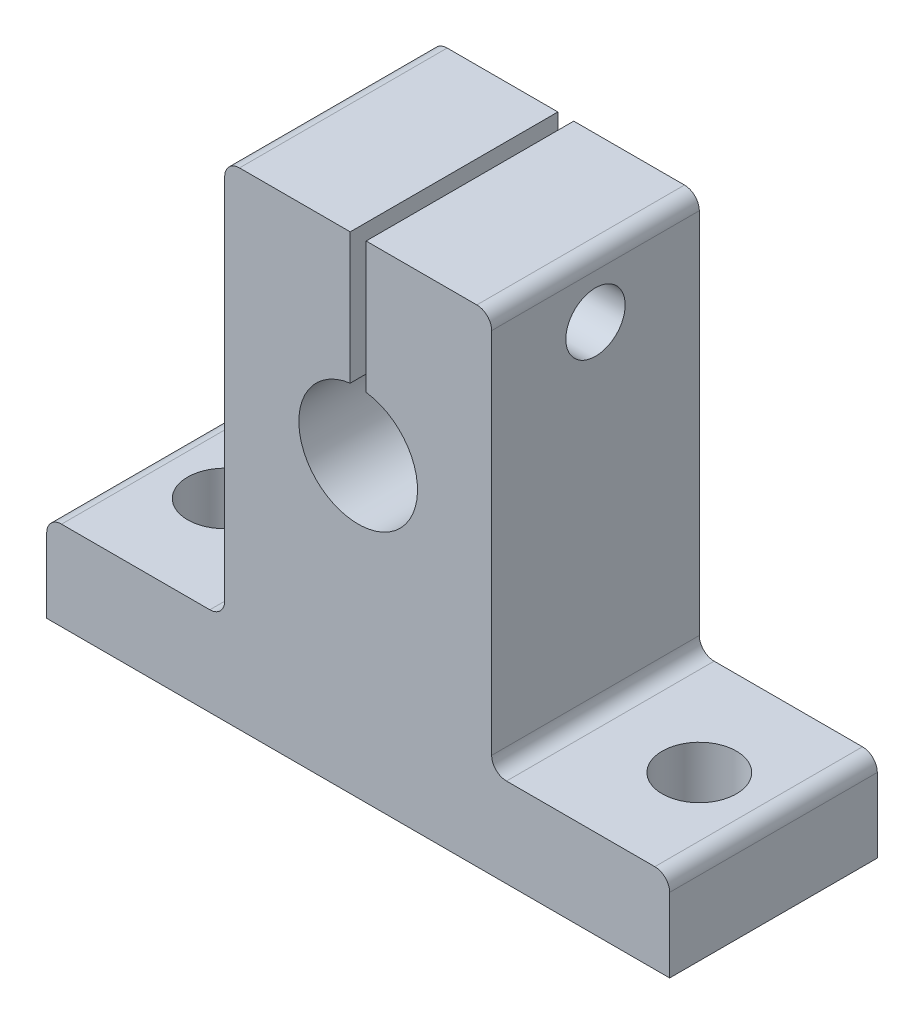
ISO-10303-21;
HEADER;
FILE_DESCRIPTION(('STEP AP214'),'2;1');
FILE_NAME('part.step','',(''),(''),'','','');
FILE_SCHEMA(('AUTOMOTIVE_DESIGN { 1 0 10303 214 1 1 1 1 }'));
ENDSEC;
DATA;
#1=APPLICATION_CONTEXT('core data for automotive mechanical design processes');
#2=APPLICATION_PROTOCOL_DEFINITION('international standard','automotive_design',2000,#1);
#3=PRODUCT_CONTEXT('',#1,'mechanical');
#4=PRODUCT('Part','Part','',(#3));
#5=PRODUCT_RELATED_PRODUCT_CATEGORY('part','',(#4));
#6=PRODUCT_DEFINITION_FORMATION('','',#4);
#7=PRODUCT_DEFINITION_CONTEXT('part definition',#1,'design');
#8=PRODUCT_DEFINITION('design','',#6,#7);
#9=PRODUCT_DEFINITION_SHAPE('','',#8);
#10=(LENGTH_UNIT() NAMED_UNIT(*) SI_UNIT(.MILLI.,.METRE.));
#11=(NAMED_UNIT(*) PLANE_ANGLE_UNIT() SI_UNIT($,.RADIAN.));
#12=(NAMED_UNIT(*) SI_UNIT($,.STERADIAN.) SOLID_ANGLE_UNIT());
#13=UNCERTAINTY_MEASURE_WITH_UNIT(LENGTH_MEASURE(1.E-05),#10,'distance_accuracy_value','');
#14=(GEOMETRIC_REPRESENTATION_CONTEXT(3) GLOBAL_UNCERTAINTY_ASSIGNED_CONTEXT((#13)) GLOBAL_UNIT_ASSIGNED_CONTEXT((#10,
#11,#12)) REPRESENTATION_CONTEXT('',''));
#15=CARTESIAN_POINT('',(0.,0.,0.));
#16=DIRECTION('',(0.,0.,1.));
#17=DIRECTION('',(1.,0.,0.));
#18=AXIS2_PLACEMENT_3D('',#15,#16,#17);
#19=CARTESIAN_POINT('',(0.,20.5272727272727,14.));
#20=DIRECTION('',(0.,1.,0.));
#21=DIRECTION('',(0.,0.,1.));
#22=AXIS2_PLACEMENT_3D('',#19,#20,#21);
#23=PLANE('',#22);
#24=DIRECTION('',(1.,0.,0.));
#25=VECTOR('',#24,1.);
#26=CARTESIAN_POINT('',(0.,20.5272727272727,0.));
#27=LINE('',#26,#25);
#28=CARTESIAN_POINT('',(-9.70707070707072,20.5272727272727,0.));
#29=VERTEX_POINT('',#28);
#30=CARTESIAN_POINT('',(-2.24269158791599,20.5272727272727,0.));
#31=VERTEX_POINT('',#30);
#32=EDGE_CURVE('E232',#29,#31,#27,.T.);
#33=ORIENTED_EDGE('',*,*,#32,.F.);
#34=DIRECTION('',(0.,0.,-1.));
#35=VECTOR('',#34,1.);
#36=CARTESIAN_POINT('',(-9.70707070707072,20.5272727272727,14.));
#37=LINE('',#36,#35);
#38=CARTESIAN_POINT('',(-9.70707070707072,20.5272727272727,14.));
#39=VERTEX_POINT('',#38);
#40=EDGE_CURVE('E166',#29,#39,#37,.F.);
#41=ORIENTED_EDGE('',*,*,#40,.T.);
#42=DIRECTION('',(1.,0.,0.));
#43=VECTOR('',#42,1.);
#44=CARTESIAN_POINT('',(0.,20.5272727272727,14.));
#45=LINE('',#44,#43);
#46=CARTESIAN_POINT('',(-2.24269158791599,20.5272727272727,14.));
#47=VERTEX_POINT('',#46);
#48=EDGE_CURVE('E161',#39,#47,#45,.T.);
#49=ORIENTED_EDGE('',*,*,#48,.T.);
#50=DIRECTION('',(0.,0.,1.));
#51=VECTOR('',#50,1.);
#52=CARTESIAN_POINT('',(-2.24269158791599,20.5272727272727,14.));
#53=LINE('',#52,#51);
#54=EDGE_CURVE('E164',#31,#47,#53,.T.);
#55=ORIENTED_EDGE('',*,*,#54,.F.);
#56=EDGE_LOOP('',(#33,#41,#49,#55));
#57=FACE_BOUND('',#56,.T.);
#58=ADVANCED_FACE('F36',(#57),#23,.T.);
#59=CARTESIAN_POINT('',(-1.17144982622544,20.5272727272727,14.));
#60=VERTEX_POINT('',#59);
#61=CARTESIAN_POINT('',(6.29292929292928,20.5272727272727,14.));
#62=VERTEX_POINT('',#61);
#63=EDGE_CURVE('E172',#60,#62,#45,.T.);
#64=ORIENTED_EDGE('',*,*,#63,.T.);
#65=DIRECTION('',(0.,0.,-1.));
#66=VECTOR('',#65,1.);
#67=CARTESIAN_POINT('',(6.29292929292928,20.5272727272727,0.));
#68=LINE('',#67,#66);
#69=CARTESIAN_POINT('',(6.29292929292928,20.5272727272727,0.));
#70=VERTEX_POINT('',#69);
#71=EDGE_CURVE('E287',#62,#70,#68,.T.);
#72=ORIENTED_EDGE('',*,*,#71,.T.);
#73=CARTESIAN_POINT('',(-1.17144982622544,20.5272727272727,0.));
#74=VERTEX_POINT('',#73);
#75=EDGE_CURVE('E231',#74,#70,#27,.T.);
#76=ORIENTED_EDGE('',*,*,#75,.F.);
#77=DIRECTION('',(0.,0.,-1.));
#78=VECTOR('',#77,1.);
#79=CARTESIAN_POINT('',(-1.17144982622544,20.5272727272727,14.));
#80=LINE('',#79,#78);
#81=EDGE_CURVE('E181',#60,#74,#80,.T.);
#82=ORIENTED_EDGE('',*,*,#81,.F.);
#83=EDGE_LOOP('',(#64,#72,#76,#82));
#84=FACE_BOUND('',#83,.T.);
#85=ADVANCED_FACE('F347',(#84),#23,.T.);
#86=CARTESIAN_POINT('',(-10.7070707070707,0.,14.));
#87=DIRECTION('',(-1.,0.,0.));
#88=DIRECTION('',(0.,0.,1.));
#89=AXIS2_PLACEMENT_3D('',#86,#87,#88);
#90=PLANE('',#89);
#91=CARTESIAN_POINT('',(-10.7070707070707,16.5272727272727,7.));
#92=DIRECTION('',(-1.,0.,0.));
#93=DIRECTION('',(0.,0.,1.));
#94=AXIS2_PLACEMENT_3D('',#91,#92,#93);
#95=CIRCLE('',#94,2.);
#96=CARTESIAN_POINT('',(-10.7070707070707,16.5272727272727,9.));
#97=VERTEX_POINT('',#96);
#98=EDGE_CURVE('E182',#97,#97,#95,.T.);
#99=ORIENTED_EDGE('',*,*,#98,.F.);
#100=EDGE_LOOP('',(#99));
#101=FACE_BOUND('',#100,.T.);
#102=DIRECTION('',(0.,1.,0.));
#103=VECTOR('',#102,1.);
#104=CARTESIAN_POINT('',(-10.7070707070707,0.,0.));
#105=LINE('',#104,#103);
#106=CARTESIAN_POINT('',(-10.7070707070707,-5.27272727272728,0.));
#107=VERTEX_POINT('',#106);
#108=CARTESIAN_POINT('',(-10.7070707070707,19.5272727272727,0.));
#109=VERTEX_POINT('',#108);
#110=EDGE_CURVE('E234',#107,#109,#105,.T.);
#111=ORIENTED_EDGE('',*,*,#110,.F.);
#112=DIRECTION('',(0.,0.,-1.));
#113=VECTOR('',#112,1.);
#114=CARTESIAN_POINT('',(-10.7070707070707,-5.27272727272728,14.));
#115=LINE('',#114,#113);
#116=CARTESIAN_POINT('',(-10.7070707070707,-5.27272727272728,14.));
#117=VERTEX_POINT('',#116);
#118=EDGE_CURVE('E306',#107,#117,#115,.F.);
#119=ORIENTED_EDGE('',*,*,#118,.T.);
#120=DIRECTION('',(0.,1.,0.));
#121=VECTOR('',#120,1.);
#122=CARTESIAN_POINT('',(-10.7070707070707,0.,14.));
#123=LINE('',#122,#121);
#124=CARTESIAN_POINT('',(-10.7070707070707,19.5272727272727,14.));
#125=VERTEX_POINT('',#124);
#126=EDGE_CURVE('E171',#117,#125,#123,.T.);
#127=ORIENTED_EDGE('',*,*,#126,.T.);
#128=DIRECTION('',(0.,0.,-1.));
#129=VECTOR('',#128,1.);
#130=CARTESIAN_POINT('',(-10.7070707070707,19.5272727272727,14.));
#131=LINE('',#130,#129);
#132=EDGE_CURVE('E261',#125,#109,#131,.T.);
#133=ORIENTED_EDGE('',*,*,#132,.T.);
#134=EDGE_LOOP('',(#111,#119,#127,#133));
#135=FACE_BOUND('',#134,.T.);
#136=ADVANCED_FACE('F331',(#101,#135),#90,.T.);
#137=CARTESIAN_POINT('',(0.,-6.27272727272728,14.));
#138=DIRECTION('',(0.,1.,0.));
#139=DIRECTION('',(-1.,0.,0.));
#140=AXIS2_PLACEMENT_3D('',#137,#138,#139);
#141=PLANE('',#140);
#142=CARTESIAN_POINT('',(-17.7070707070707,-6.27272727272727,7.));
#143=DIRECTION('',(0.,1.,0.));
#144=DIRECTION('',(-1.,0.,0.));
#145=AXIS2_PLACEMENT_3D('',#142,#143,#144);
#146=CIRCLE('',#145,2.5);
#147=CARTESIAN_POINT('',(-20.2070707070707,-6.27272727272727,7.));
#148=VERTEX_POINT('',#147);
#149=EDGE_CURVE('E199',#148,#148,#146,.T.);
#150=ORIENTED_EDGE('',*,*,#149,.F.);
#151=EDGE_LOOP('',(#150));
#152=FACE_BOUND('',#151,.T.);
#153=DIRECTION('',(1.,0.,0.));
#154=VECTOR('',#153,1.);
#155=CARTESIAN_POINT('',(0.,-6.27272727272728,14.));
#156=LINE('',#155,#154);
#157=CARTESIAN_POINT('',(-21.7070707070707,-6.27272727272727,14.));
#158=VERTEX_POINT('',#157);
#159=CARTESIAN_POINT('',(-11.7070707070707,-6.27272727272728,14.));
#160=VERTEX_POINT('',#159);
#161=EDGE_CURVE('E211',#158,#160,#156,.T.);
#162=ORIENTED_EDGE('',*,*,#161,.T.);
#163=DIRECTION('',(0.,0.,-1.));
#164=VECTOR('',#163,1.);
#165=CARTESIAN_POINT('',(-11.7070707070707,-6.27272727272728,0.));
#166=LINE('',#165,#164);
#167=CARTESIAN_POINT('',(-11.7070707070707,-6.27272727272728,0.));
#168=VERTEX_POINT('',#167);
#169=EDGE_CURVE('E303',#160,#168,#166,.T.);
#170=ORIENTED_EDGE('',*,*,#169,.T.);
#171=DIRECTION('',(1.,0.,0.));
#172=VECTOR('',#171,1.);
#173=CARTESIAN_POINT('',(0.,-6.27272727272728,0.));
#174=LINE('',#173,#172);
#175=CARTESIAN_POINT('',(-21.7070707070707,-6.27272727272727,0.));
#176=VERTEX_POINT('',#175);
#177=EDGE_CURVE('E236',#176,#168,#174,.T.);
#178=ORIENTED_EDGE('',*,*,#177,.F.);
#179=DIRECTION('',(0.,0.,-1.));
#180=VECTOR('',#179,1.);
#181=CARTESIAN_POINT('',(-21.7070707070707,-6.27272727272727,14.));
#182=LINE('',#181,#180);
#183=EDGE_CURVE('E296',#176,#158,#182,.F.);
#184=ORIENTED_EDGE('',*,*,#183,.T.);
#185=EDGE_LOOP('',(#162,#170,#178,#184));
#186=FACE_BOUND('',#185,.T.);
#187=ADVANCED_FACE('F323',(#152,#186),#141,.T.);
#188=CARTESIAN_POINT('',(-22.7070707070707,0.,14.));
#189=DIRECTION('',(-1.,0.,0.));
#190=DIRECTION('',(0.,0.,1.));
#191=AXIS2_PLACEMENT_3D('',#188,#189,#190);
#192=PLANE('',#191);
#193=DIRECTION('',(0.,1.,0.));
#194=VECTOR('',#193,1.);
#195=CARTESIAN_POINT('',(-22.7070707070707,0.,14.));
#196=LINE('',#195,#194);
#197=CARTESIAN_POINT('',(-22.7070707070707,-12.2727272727273,14.));
#198=VERTEX_POINT('',#197);
#199=CARTESIAN_POINT('',(-22.7070707070707,-7.27272727272727,14.));
#200=VERTEX_POINT('',#199);
#201=EDGE_CURVE('E214',#198,#200,#196,.T.);
#202=ORIENTED_EDGE('',*,*,#201,.T.);
#203=DIRECTION('',(0.,0.,-1.));
#204=VECTOR('',#203,1.);
#205=CARTESIAN_POINT('',(-22.7070707070707,-7.27272727272727,14.));
#206=LINE('',#205,#204);
#207=CARTESIAN_POINT('',(-22.7070707070707,-7.27272727272727,0.));
#208=VERTEX_POINT('',#207);
#209=EDGE_CURVE('E293',#200,#208,#206,.T.);
#210=ORIENTED_EDGE('',*,*,#209,.T.);
#211=DIRECTION('',(0.,1.,0.));
#212=VECTOR('',#211,1.);
#213=CARTESIAN_POINT('',(-22.7070707070707,0.,0.));
#214=LINE('',#213,#212);
#215=CARTESIAN_POINT('',(-22.7070707070707,-12.2727272727273,0.));
#216=VERTEX_POINT('',#215);
#217=EDGE_CURVE('E239',#216,#208,#214,.T.);
#218=ORIENTED_EDGE('',*,*,#217,.F.);
#219=DIRECTION('',(0.,0.,-1.));
#220=VECTOR('',#219,1.);
#221=CARTESIAN_POINT('',(-22.7070707070707,-12.2727272727273,14.));
#222=LINE('',#221,#220);
#223=EDGE_CURVE('E253',#198,#216,#222,.T.);
#224=ORIENTED_EDGE('',*,*,#223,.F.);
#225=EDGE_LOOP('',(#202,#210,#218,#224));
#226=FACE_BOUND('',#225,.T.);
#227=ADVANCED_FACE('F374',(#226),#192,.T.);
#228=CARTESIAN_POINT('',(0.,-12.2727272727273,14.));
#229=DIRECTION('',(0.,1.,0.));
#230=DIRECTION('',(0.,0.,1.));
#231=AXIS2_PLACEMENT_3D('',#228,#229,#230);
#232=PLANE('',#231);
#233=CARTESIAN_POINT('',(-17.7070707070707,-12.2727272727273,7.));
#234=DIRECTION('',(0.,1.,0.));
#235=DIRECTION('',(0.,0.,1.));
#236=AXIS2_PLACEMENT_3D('',#233,#234,#235);
#237=CIRCLE('',#236,2.5);
#238=CARTESIAN_POINT('',(-17.7070707070707,-12.2727272727273,9.5));
#239=VERTEX_POINT('',#238);
#240=EDGE_CURVE('E207',#239,#239,#237,.T.);
#241=ORIENTED_EDGE('',*,*,#240,.T.);
#242=EDGE_LOOP('',(#241));
#243=FACE_BOUND('',#242,.T.);
#244=CARTESIAN_POINT('',(14.2929292929293,-12.2727272727273,7.));
#245=DIRECTION('',(0.,1.,0.));
#246=DIRECTION('',(0.,0.,1.));
#247=AXIS2_PLACEMENT_3D('',#244,#245,#246);
#248=CIRCLE('',#247,2.5);
#249=CARTESIAN_POINT('',(14.2929292929293,-12.2727272727273,9.5));
#250=VERTEX_POINT('',#249);
#251=EDGE_CURVE('E202',#250,#250,#248,.T.);
#252=ORIENTED_EDGE('',*,*,#251,.T.);
#253=EDGE_LOOP('',(#252));
#254=FACE_BOUND('',#253,.T.);
#255=DIRECTION('',(1.,0.,0.));
#256=VECTOR('',#255,1.);
#257=CARTESIAN_POINT('',(0.,-12.2727272727273,0.));
#258=LINE('',#257,#256);
#259=CARTESIAN_POINT('',(19.2929292929293,-12.2727272727273,0.));
#260=VERTEX_POINT('',#259);
#261=EDGE_CURVE('E242',#216,#260,#258,.T.);
#262=ORIENTED_EDGE('',*,*,#261,.T.);
#263=DIRECTION('',(0.,0.,-1.));
#264=VECTOR('',#263,1.);
#265=CARTESIAN_POINT('',(19.2929292929293,-12.2727272727273,14.));
#266=LINE('',#265,#264);
#267=CARTESIAN_POINT('',(19.2929292929293,-12.2727272727273,14.));
#268=VERTEX_POINT('',#267);
#269=EDGE_CURVE('E227',#268,#260,#266,.T.);
#270=ORIENTED_EDGE('',*,*,#269,.F.);
#271=DIRECTION('',(1.,0.,0.));
#272=VECTOR('',#271,1.);
#273=CARTESIAN_POINT('',(0.,-12.2727272727273,14.));
#274=LINE('',#273,#272);
#275=EDGE_CURVE('E217',#198,#268,#274,.T.);
#276=ORIENTED_EDGE('',*,*,#275,.F.);
#277=ORIENTED_EDGE('',*,*,#223,.T.);
#278=EDGE_LOOP('',(#262,#270,#276,#277));
#279=FACE_BOUND('',#278,.T.);
#280=ADVANCED_FACE('F371',(#243,#254,#279),#232,.F.);
#281=CARTESIAN_POINT('',(19.2929292929293,0.,14.));
#282=DIRECTION('',(-1.,0.,0.));
#283=DIRECTION('',(0.,0.,1.));
#284=AXIS2_PLACEMENT_3D('',#281,#282,#283);
#285=PLANE('',#284);
#286=DIRECTION('',(0.,1.,0.));
#287=VECTOR('',#286,1.);
#288=CARTESIAN_POINT('',(19.2929292929293,0.,0.));
#289=LINE('',#288,#287);
#290=CARTESIAN_POINT('',(19.2929292929293,-7.27272727272727,0.));
#291=VERTEX_POINT('',#290);
#292=EDGE_CURVE('E245',#260,#291,#289,.T.);
#293=ORIENTED_EDGE('',*,*,#292,.T.);
#294=DIRECTION('',(0.,0.,-1.));
#295=VECTOR('',#294,1.);
#296=CARTESIAN_POINT('',(19.2929292929293,-7.27272727272727,14.));
#297=LINE('',#296,#295);
#298=CARTESIAN_POINT('',(19.2929292929293,-7.27272727272727,14.));
#299=VERTEX_POINT('',#298);
#300=EDGE_CURVE('E301',#291,#299,#297,.F.);
#301=ORIENTED_EDGE('',*,*,#300,.T.);
#302=DIRECTION('',(0.,1.,0.));
#303=VECTOR('',#302,1.);
#304=CARTESIAN_POINT('',(19.2929292929293,0.,14.));
#305=LINE('',#304,#303);
#306=EDGE_CURVE('E220',#268,#299,#305,.T.);
#307=ORIENTED_EDGE('',*,*,#306,.F.);
#308=ORIENTED_EDGE('',*,*,#269,.T.);
#309=EDGE_LOOP('',(#293,#301,#307,#308));
#310=FACE_BOUND('',#309,.T.);
#311=ADVANCED_FACE('F367',(#310),#285,.F.);
#312=CARTESIAN_POINT('',(0.,-6.27272727272728,14.));
#313=DIRECTION('',(0.,-1.,0.));
#314=DIRECTION('',(1.,0.,0.));
#315=AXIS2_PLACEMENT_3D('',#312,#313,#314);
#316=PLANE('',#315);
#317=CARTESIAN_POINT('',(14.2929292929293,-6.27272727272728,7.));
#318=DIRECTION('',(0.,1.,0.));
#319=DIRECTION('',(-1.,0.,0.));
#320=AXIS2_PLACEMENT_3D('',#317,#318,#319);
#321=CIRCLE('',#320,2.5);
#322=CARTESIAN_POINT('',(11.7929292929293,-6.27272727272728,7.));
#323=VERTEX_POINT('',#322);
#324=EDGE_CURVE('E198',#323,#323,#321,.T.);
#325=ORIENTED_EDGE('',*,*,#324,.F.);
#326=EDGE_LOOP('',(#325));
#327=FACE_BOUND('',#326,.T.);
#328=DIRECTION('',(-1.,0.,0.));
#329=VECTOR('',#328,1.);
#330=CARTESIAN_POINT('',(0.,-6.27272727272728,0.));
#331=LINE('',#330,#329);
#332=CARTESIAN_POINT('',(18.2929292929293,-6.27272727272727,0.));
#333=VERTEX_POINT('',#332);
#334=CARTESIAN_POINT('',(8.29292929292928,-6.27272727272728,0.));
#335=VERTEX_POINT('',#334);
#336=EDGE_CURVE('E248',#333,#335,#331,.T.);
#337=ORIENTED_EDGE('',*,*,#336,.T.);
#338=DIRECTION('',(0.,0.,-1.));
#339=VECTOR('',#338,1.);
#340=CARTESIAN_POINT('',(8.29292929292928,-6.27272727272728,14.));
#341=LINE('',#340,#339);
#342=CARTESIAN_POINT('',(8.29292929292928,-6.27272727272728,14.));
#343=VERTEX_POINT('',#342);
#344=EDGE_CURVE('E57',#335,#343,#341,.F.);
#345=ORIENTED_EDGE('',*,*,#344,.T.);
#346=DIRECTION('',(-1.,0.,0.));
#347=VECTOR('',#346,1.);
#348=CARTESIAN_POINT('',(0.,-6.27272727272728,14.));
#349=LINE('',#348,#347);
#350=CARTESIAN_POINT('',(18.2929292929293,-6.27272727272727,14.));
#351=VERTEX_POINT('',#350);
#352=EDGE_CURVE('E223',#351,#343,#349,.T.);
#353=ORIENTED_EDGE('',*,*,#352,.F.);
#354=DIRECTION('',(0.,0.,-1.));
#355=VECTOR('',#354,1.);
#356=CARTESIAN_POINT('',(18.2929292929293,-6.27272727272727,14.));
#357=LINE('',#356,#355);
#358=EDGE_CURVE('E298',#351,#333,#357,.T.);
#359=ORIENTED_EDGE('',*,*,#358,.T.);
#360=EDGE_LOOP('',(#337,#345,#353,#359));
#361=FACE_BOUND('',#360,.T.);
#362=ADVANCED_FACE('F361',(#327,#361),#316,.F.);
#363=CARTESIAN_POINT('',(-1.70707070707072,7.72727272727273,14.));
#364=DIRECTION('',(0.,0.,-1.));
#365=DIRECTION('',(-1.,0.,0.));
#366=AXIS2_PLACEMENT_3D('',#363,#364,#365);
#367=CYLINDRICAL_SURFACE('',#366,4.);
#368=DIRECTION('',(0.,0.,-1.));
#369=VECTOR('',#368,1.);
#370=CARTESIAN_POINT('',(-2.24269158791599,11.6912493003622,14.));
#371=LINE('',#370,#369);
#372=CARTESIAN_POINT('',(-2.24269158791599,11.6912493003622,14.));
#373=VERTEX_POINT('',#372);
#374=CARTESIAN_POINT('',(-2.24269158791599,11.6912493003622,0.));
#375=VERTEX_POINT('',#374);
#376=EDGE_CURVE('E196',#373,#375,#371,.T.);
#377=ORIENTED_EDGE('',*,*,#376,.F.);
#378=CARTESIAN_POINT('',(-1.70707070707072,7.72727272727273,14.));
#379=DIRECTION('',(0.,0.,1.));
#380=DIRECTION('',(1.,0.,0.));
#381=AXIS2_PLACEMENT_3D('',#378,#379,#380);
#382=CIRCLE('',#381,4.);
#383=CARTESIAN_POINT('',(-1.17144982622544,11.6912493003622,14.));
#384=VERTEX_POINT('',#383);
#385=EDGE_CURVE('E188',#373,#384,#382,.T.);
#386=ORIENTED_EDGE('',*,*,#385,.T.);
#387=DIRECTION('',(0.,0.,-1.));
#388=VECTOR('',#387,1.);
#389=CARTESIAN_POINT('',(-1.17144982622544,11.6912493003622,14.));
#390=LINE('',#389,#388);
#391=CARTESIAN_POINT('',(-1.17144982622544,11.6912493003622,0.));
#392=VERTEX_POINT('',#391);
#393=EDGE_CURVE('E191',#392,#384,#390,.F.);
#394=ORIENTED_EDGE('',*,*,#393,.F.);
#395=CARTESIAN_POINT('',(-1.70707070707072,7.72727272727273,0.));
#396=DIRECTION('',(0.,0.,1.));
#397=DIRECTION('',(1.,0.,0.));
#398=AXIS2_PLACEMENT_3D('',#395,#396,#397);
#399=CIRCLE('',#398,4.);
#400=EDGE_CURVE('E228',#375,#392,#399,.T.);
#401=ORIENTED_EDGE('',*,*,#400,.F.);
#402=EDGE_LOOP('',(#377,#386,#394,#401));
#403=FACE_BOUND('',#402,.T.);
#404=ADVANCED_FACE('F338',(#403),#367,.F.);
#405=CARTESIAN_POINT('',(7.29292929292928,0.,14.));
#406=DIRECTION('',(-1.,0.,0.));
#407=DIRECTION('',(0.,0.,1.));
#408=AXIS2_PLACEMENT_3D('',#405,#406,#407);
#409=PLANE('',#408);
#410=CARTESIAN_POINT('',(7.29292929292928,16.5272727272727,7.));
#411=DIRECTION('',(1.,0.,0.));
#412=DIRECTION('',(0.,0.,-1.));
#413=AXIS2_PLACEMENT_3D('',#410,#411,#412);
#414=CIRCLE('',#413,2.);
#415=CARTESIAN_POINT('',(7.29292929292928,16.5272727272727,5.));
#416=VERTEX_POINT('',#415);
#417=EDGE_CURVE('E266',#416,#416,#414,.T.);
#418=ORIENTED_EDGE('',*,*,#417,.F.);
#419=EDGE_LOOP('',(#418));
#420=FACE_BOUND('',#419,.T.);
#421=DIRECTION('',(0.,1.,0.));
#422=VECTOR('',#421,1.);
#423=CARTESIAN_POINT('',(7.29292929292928,0.,14.));
#424=LINE('',#423,#422);
#425=CARTESIAN_POINT('',(7.29292929292928,-5.27272727272728,14.));
#426=VERTEX_POINT('',#425);
#427=CARTESIAN_POINT('',(7.29292929292928,19.5272727272727,14.));
#428=VERTEX_POINT('',#427);
#429=EDGE_CURVE('E225',#426,#428,#424,.T.);
#430=ORIENTED_EDGE('',*,*,#429,.F.);
#431=DIRECTION('',(0.,0.,-1.));
#432=VECTOR('',#431,1.);
#433=CARTESIAN_POINT('',(7.29292929292928,-5.27272727272728,0.));
#434=LINE('',#433,#432);
#435=CARTESIAN_POINT('',(7.29292929292928,-5.27272727272728,0.));
#436=VERTEX_POINT('',#435);
#437=EDGE_CURVE('E308',#426,#436,#434,.T.);
#438=ORIENTED_EDGE('',*,*,#437,.T.);
#439=DIRECTION('',(0.,1.,0.));
#440=VECTOR('',#439,1.);
#441=CARTESIAN_POINT('',(7.29292929292928,0.,0.));
#442=LINE('',#441,#440);
#443=CARTESIAN_POINT('',(7.29292929292928,19.5272727272727,0.));
#444=VERTEX_POINT('',#443);
#445=EDGE_CURVE('E208',#436,#444,#442,.T.);
#446=ORIENTED_EDGE('',*,*,#445,.T.);
#447=DIRECTION('',(0.,0.,-1.));
#448=VECTOR('',#447,1.);
#449=CARTESIAN_POINT('',(7.29292929292928,19.5272727272727,14.));
#450=LINE('',#449,#448);
#451=EDGE_CURVE('E290',#444,#428,#450,.F.);
#452=ORIENTED_EDGE('',*,*,#451,.T.);
#453=EDGE_LOOP('',(#430,#438,#446,#452));
#454=FACE_BOUND('',#453,.T.);
#455=ADVANCED_FACE('F355',(#420,#454),#409,.F.);
#456=CARTESIAN_POINT('',(0.,0.,14.));
#457=DIRECTION('',(0.,0.,1.));
#458=DIRECTION('',(1.,0.,0.));
#459=AXIS2_PLACEMENT_3D('',#456,#457,#458);
#460=PLANE('',#459);
#461=ORIENTED_EDGE('',*,*,#48,.F.);
#462=CARTESIAN_POINT('',(-9.70707070707072,19.5272727272727,14.));
#463=DIRECTION('',(0.,0.,1.));
#464=DIRECTION('',(1.,0.,0.));
#465=AXIS2_PLACEMENT_3D('',#462,#463,#464);
#466=CIRCLE('',#465,1.);
#467=EDGE_CURVE('E285',#39,#125,#466,.T.);
#468=ORIENTED_EDGE('',*,*,#467,.T.);
#469=ORIENTED_EDGE('',*,*,#126,.F.);
#470=CARTESIAN_POINT('',(-11.7070707070707,-5.27272727272728,14.));
#471=DIRECTION('',(0.,0.,1.));
#472=DIRECTION('',(1.,0.,0.));
#473=AXIS2_PLACEMENT_3D('',#470,#471,#472);
#474=CIRCLE('',#473,1.);
#475=EDGE_CURVE('E314',#117,#160,#474,.F.);
#476=ORIENTED_EDGE('',*,*,#475,.T.);
#477=ORIENTED_EDGE('',*,*,#161,.F.);
#478=CARTESIAN_POINT('',(-21.7070707070707,-7.27272727272727,14.));
#479=DIRECTION('',(0.,0.,1.));
#480=DIRECTION('',(1.,0.,0.));
#481=AXIS2_PLACEMENT_3D('',#478,#479,#480);
#482=CIRCLE('',#481,1.);
#483=EDGE_CURVE('E281',#158,#200,#482,.T.);
#484=ORIENTED_EDGE('',*,*,#483,.T.);
#485=ORIENTED_EDGE('',*,*,#201,.F.);
#486=ORIENTED_EDGE('',*,*,#275,.T.);
#487=ORIENTED_EDGE('',*,*,#306,.T.);
#488=CARTESIAN_POINT('',(18.2929292929293,-7.27272727272727,14.));
#489=DIRECTION('',(0.,0.,1.));
#490=DIRECTION('',(1.,0.,0.));
#491=AXIS2_PLACEMENT_3D('',#488,#489,#490);
#492=CIRCLE('',#491,1.);
#493=EDGE_CURVE('E279',#299,#351,#492,.T.);
#494=ORIENTED_EDGE('',*,*,#493,.T.);
#495=ORIENTED_EDGE('',*,*,#352,.T.);
#496=CARTESIAN_POINT('',(8.29292929292928,-5.27272727272728,14.));
#497=DIRECTION('',(0.,0.,1.));
#498=DIRECTION('',(1.,0.,0.));
#499=AXIS2_PLACEMENT_3D('',#496,#497,#498);
#500=CIRCLE('',#499,1.);
#501=EDGE_CURVE('E11',#343,#426,#500,.F.);
#502=ORIENTED_EDGE('',*,*,#501,.T.);
#503=ORIENTED_EDGE('',*,*,#429,.T.);
#504=CARTESIAN_POINT('',(6.29292929292928,19.5272727272727,14.));
#505=DIRECTION('',(0.,0.,1.));
#506=DIRECTION('',(1.,0.,0.));
#507=AXIS2_PLACEMENT_3D('',#504,#505,#506);
#508=CIRCLE('',#507,1.);
#509=EDGE_CURVE('E283',#428,#62,#508,.T.);
#510=ORIENTED_EDGE('',*,*,#509,.T.);
#511=ORIENTED_EDGE('',*,*,#63,.F.);
#512=DIRECTION('',(0.,1.,0.));
#513=VECTOR('',#512,1.);
#514=CARTESIAN_POINT('',(-1.17144982622544,6.52727272727272,14.));
#515=LINE('',#514,#513);
#516=EDGE_CURVE('E189',#384,#60,#515,.T.);
#517=ORIENTED_EDGE('',*,*,#516,.F.);
#518=ORIENTED_EDGE('',*,*,#385,.F.);
#519=DIRECTION('',(0.,1.,0.));
#520=VECTOR('',#519,1.);
#521=CARTESIAN_POINT('',(-2.24269158791599,6.52727272727272,14.));
#522=LINE('',#521,#520);
#523=EDGE_CURVE('E177',#373,#47,#522,.T.);
#524=ORIENTED_EDGE('',*,*,#523,.T.);
#525=EDGE_LOOP('',(#461,#468,#469,#476,#477,#484,#485,#486,#487,#494,#495,#502,#503,#510,#511,
#517,#518,#524));
#526=FACE_BOUND('',#525,.T.);
#527=ADVANCED_FACE('F185',(#526),#460,.T.);
#528=CARTESIAN_POINT('',(0.,0.,0.));
#529=DIRECTION('',(0.,0.,1.));
#530=DIRECTION('',(1.,0.,0.));
#531=AXIS2_PLACEMENT_3D('',#528,#529,#530);
#532=PLANE('',#531);
#533=ORIENTED_EDGE('',*,*,#177,.T.);
#534=CARTESIAN_POINT('',(-11.7070707070707,-5.27272727272728,0.));
#535=DIRECTION('',(0.,0.,1.));
#536=DIRECTION('',(1.,0.,0.));
#537=AXIS2_PLACEMENT_3D('',#534,#535,#536);
#538=CIRCLE('',#537,1.);
#539=EDGE_CURVE('E312',#168,#107,#538,.T.);
#540=ORIENTED_EDGE('',*,*,#539,.T.);
#541=ORIENTED_EDGE('',*,*,#110,.T.);
#542=CARTESIAN_POINT('',(-9.70707070707072,19.5272727272727,0.));
#543=DIRECTION('',(0.,0.,1.));
#544=DIRECTION('',(1.,0.,0.));
#545=AXIS2_PLACEMENT_3D('',#542,#543,#544);
#546=CIRCLE('',#545,1.);
#547=EDGE_CURVE('E276',#109,#29,#546,.F.);
#548=ORIENTED_EDGE('',*,*,#547,.T.);
#549=ORIENTED_EDGE('',*,*,#32,.T.);
#550=DIRECTION('',(0.,-1.,0.));
#551=VECTOR('',#550,1.);
#552=CARTESIAN_POINT('',(-2.24269158791599,0.,0.));
#553=LINE('',#552,#551);
#554=EDGE_CURVE('E180',#31,#375,#553,.T.);
#555=ORIENTED_EDGE('',*,*,#554,.T.);
#556=ORIENTED_EDGE('',*,*,#400,.T.);
#557=DIRECTION('',(0.,1.,0.));
#558=VECTOR('',#557,1.);
#559=CARTESIAN_POINT('',(-1.17144982622544,0.,0.));
#560=LINE('',#559,#558);
#561=EDGE_CURVE('E255',#392,#74,#560,.T.);
#562=ORIENTED_EDGE('',*,*,#561,.T.);
#563=ORIENTED_EDGE('',*,*,#75,.T.);
#564=CARTESIAN_POINT('',(6.29292929292928,19.5272727272727,0.));
#565=DIRECTION('',(0.,0.,1.));
#566=DIRECTION('',(1.,0.,0.));
#567=AXIS2_PLACEMENT_3D('',#564,#565,#566);
#568=CIRCLE('',#567,1.);
#569=EDGE_CURVE('E273',#70,#444,#568,.F.);
#570=ORIENTED_EDGE('',*,*,#569,.T.);
#571=ORIENTED_EDGE('',*,*,#445,.F.);
#572=CARTESIAN_POINT('',(8.29292929292928,-5.27272727272728,0.));
#573=DIRECTION('',(0.,0.,1.));
#574=DIRECTION('',(1.,0.,0.));
#575=AXIS2_PLACEMENT_3D('',#572,#573,#574);
#576=CIRCLE('',#575,1.);
#577=EDGE_CURVE('E44',#436,#335,#576,.T.);
#578=ORIENTED_EDGE('',*,*,#577,.T.);
#579=ORIENTED_EDGE('',*,*,#336,.F.);
#580=CARTESIAN_POINT('',(18.2929292929293,-7.27272727272727,0.));
#581=DIRECTION('',(0.,0.,1.));
#582=DIRECTION('',(1.,0.,0.));
#583=AXIS2_PLACEMENT_3D('',#580,#581,#582);
#584=CIRCLE('',#583,1.);
#585=EDGE_CURVE('E269',#333,#291,#584,.F.);
#586=ORIENTED_EDGE('',*,*,#585,.T.);
#587=ORIENTED_EDGE('',*,*,#292,.F.);
#588=ORIENTED_EDGE('',*,*,#261,.F.);
#589=ORIENTED_EDGE('',*,*,#217,.T.);
#590=CARTESIAN_POINT('',(-21.7070707070707,-7.27272727272727,0.));
#591=DIRECTION('',(0.,0.,1.));
#592=DIRECTION('',(1.,0.,0.));
#593=AXIS2_PLACEMENT_3D('',#590,#591,#592);
#594=CIRCLE('',#593,1.);
#595=EDGE_CURVE('E271',#208,#176,#594,.F.);
#596=ORIENTED_EDGE('',*,*,#595,.T.);
#597=EDGE_LOOP('',(#533,#540,#541,#548,#549,#555,#556,#562,#563,#570,#571,#578,#579,#586,#587,
#588,#589,#596));
#598=FACE_BOUND('',#597,.T.);
#599=ADVANCED_FACE('F328',(#598),#532,.F.);
#600=CARTESIAN_POINT('',(14.2929292929293,-20.2727272727273,7.));
#601=DIRECTION('',(0.,1.,0.));
#602=DIRECTION('',(-1.,0.,0.));
#603=AXIS2_PLACEMENT_3D('',#600,#601,#602);
#604=CYLINDRICAL_SURFACE('',#603,2.5);
#605=ORIENTED_EDGE('',*,*,#324,.T.);
#606=EDGE_LOOP('',(#605));
#607=FACE_BOUND('',#606,.T.);
#608=ORIENTED_EDGE('',*,*,#251,.F.);
#609=EDGE_LOOP('',(#608));
#610=FACE_BOUND('',#609,.T.);
#611=ADVANCED_FACE('F421',(#607,#610),#604,.F.);
#612=CARTESIAN_POINT('',(-17.7070707070707,-20.2727272727273,7.));
#613=DIRECTION('',(0.,1.,0.));
#614=DIRECTION('',(-1.,0.,0.));
#615=AXIS2_PLACEMENT_3D('',#612,#613,#614);
#616=CYLINDRICAL_SURFACE('',#615,2.5);
#617=ORIENTED_EDGE('',*,*,#149,.T.);
#618=EDGE_LOOP('',(#617));
#619=FACE_BOUND('',#618,.T.);
#620=ORIENTED_EDGE('',*,*,#240,.F.);
#621=EDGE_LOOP('',(#620));
#622=FACE_BOUND('',#621,.T.);
#623=ADVANCED_FACE('F414',(#619,#622),#616,.F.);
#624=CARTESIAN_POINT('',(-1.17144982622544,6.52727272727272,14.));
#625=DIRECTION('',(1.,0.,0.));
#626=DIRECTION('',(0.,0.,-1.));
#627=AXIS2_PLACEMENT_3D('',#624,#625,#626);
#628=PLANE('',#627);
#629=CARTESIAN_POINT('',(-1.17144982622544,16.5272727272727,7.));
#630=DIRECTION('',(1.,0.,0.));
#631=DIRECTION('',(0.,0.,-1.));
#632=AXIS2_PLACEMENT_3D('',#629,#630,#631);
#633=CIRCLE('',#632,2.);
#634=CARTESIAN_POINT('',(-1.17144982622544,16.5272727272727,5.));
#635=VERTEX_POINT('',#634);
#636=EDGE_CURVE('E265',#635,#635,#633,.T.);
#637=ORIENTED_EDGE('',*,*,#636,.T.);
#638=EDGE_LOOP('',(#637));
#639=FACE_BOUND('',#638,.T.);
#640=ORIENTED_EDGE('',*,*,#393,.T.);
#641=ORIENTED_EDGE('',*,*,#516,.T.);
#642=ORIENTED_EDGE('',*,*,#81,.T.);
#643=ORIENTED_EDGE('',*,*,#561,.F.);
#644=EDGE_LOOP('',(#640,#641,#642,#643));
#645=FACE_BOUND('',#644,.T.);
#646=ADVANCED_FACE('F340',(#639,#645),#628,.F.);
#647=CARTESIAN_POINT('',(-2.24269158791599,6.52727272727272,14.));
#648=DIRECTION('',(-1.,0.,0.));
#649=DIRECTION('',(0.,0.,1.));
#650=AXIS2_PLACEMENT_3D('',#647,#648,#649);
#651=PLANE('',#650);
#652=CARTESIAN_POINT('',(-2.24269158791599,16.5272727272727,7.));
#653=DIRECTION('',(-1.,0.,0.));
#654=DIRECTION('',(0.,0.,1.));
#655=AXIS2_PLACEMENT_3D('',#652,#653,#654);
#656=CIRCLE('',#655,2.);
#657=CARTESIAN_POINT('',(-2.24269158791599,16.5272727272727,9.));
#658=VERTEX_POINT('',#657);
#659=EDGE_CURVE('E262',#658,#658,#656,.T.);
#660=ORIENTED_EDGE('',*,*,#659,.T.);
#661=EDGE_LOOP('',(#660));
#662=FACE_BOUND('',#661,.T.);
#663=ORIENTED_EDGE('',*,*,#376,.T.);
#664=ORIENTED_EDGE('',*,*,#554,.F.);
#665=ORIENTED_EDGE('',*,*,#54,.T.);
#666=ORIENTED_EDGE('',*,*,#523,.F.);
#667=EDGE_LOOP('',(#663,#664,#665,#666));
#668=FACE_BOUND('',#667,.T.);
#669=ADVANCED_FACE('F176',(#662,#668),#651,.F.);
#670=CARTESIAN_POINT('',(-52.7070707070707,16.5272727272727,7.));
#671=DIRECTION('',(1.,0.,0.));
#672=DIRECTION('',(0.,0.,-1.));
#673=AXIS2_PLACEMENT_3D('',#670,#671,#672);
#674=CYLINDRICAL_SURFACE('',#673,2.);
#675=ORIENTED_EDGE('',*,*,#98,.T.);
#676=EDGE_LOOP('',(#675));
#677=FACE_BOUND('',#676,.T.);
#678=ORIENTED_EDGE('',*,*,#659,.F.);
#679=EDGE_LOOP('',(#678));
#680=FACE_BOUND('',#679,.T.);
#681=ADVANCED_FACE('F402',(#677,#680),#674,.F.);
#682=ORIENTED_EDGE('',*,*,#417,.T.);
#683=EDGE_LOOP('',(#682));
#684=FACE_BOUND('',#683,.T.);
#685=ORIENTED_EDGE('',*,*,#636,.F.);
#686=EDGE_LOOP('',(#685));
#687=FACE_BOUND('',#686,.T.);
#688=ADVANCED_FACE('F398',(#684,#687),#674,.F.);
#689=CARTESIAN_POINT('',(-9.70707070707072,19.5272727272727,14.));
#690=DIRECTION('',(0.,0.,-1.));
#691=DIRECTION('',(-1.,0.,0.));
#692=AXIS2_PLACEMENT_3D('',#689,#690,#691);
#693=CYLINDRICAL_SURFACE('',#692,1.);
#694=ORIENTED_EDGE('',*,*,#467,.F.);
#695=ORIENTED_EDGE('',*,*,#40,.F.);
#696=ORIENTED_EDGE('',*,*,#547,.F.);
#697=ORIENTED_EDGE('',*,*,#132,.F.);
#698=EDGE_LOOP('',(#694,#695,#696,#697));
#699=FACE_BOUND('',#698,.T.);
#700=ADVANCED_FACE('F334',(#699),#693,.T.);
#701=CARTESIAN_POINT('',(6.29292929292928,19.5272727272727,14.));
#702=DIRECTION('',(0.,0.,1.));
#703=DIRECTION('',(1.,0.,0.));
#704=AXIS2_PLACEMENT_3D('',#701,#702,#703);
#705=CYLINDRICAL_SURFACE('',#704,1.);
#706=ORIENTED_EDGE('',*,*,#509,.F.);
#707=ORIENTED_EDGE('',*,*,#451,.F.);
#708=ORIENTED_EDGE('',*,*,#569,.F.);
#709=ORIENTED_EDGE('',*,*,#71,.F.);
#710=EDGE_LOOP('',(#706,#707,#708,#709));
#711=FACE_BOUND('',#710,.T.);
#712=ADVANCED_FACE('F351',(#711),#705,.T.);
#713=CARTESIAN_POINT('',(-21.7070707070707,-7.27272727272727,14.));
#714=DIRECTION('',(0.,0.,-1.));
#715=DIRECTION('',(-1.,0.,0.));
#716=AXIS2_PLACEMENT_3D('',#713,#714,#715);
#717=CYLINDRICAL_SURFACE('',#716,1.);
#718=ORIENTED_EDGE('',*,*,#483,.F.);
#719=ORIENTED_EDGE('',*,*,#183,.F.);
#720=ORIENTED_EDGE('',*,*,#595,.F.);
#721=ORIENTED_EDGE('',*,*,#209,.F.);
#722=EDGE_LOOP('',(#718,#719,#720,#721));
#723=FACE_BOUND('',#722,.T.);
#724=ADVANCED_FACE('F378',(#723),#717,.T.);
#725=CARTESIAN_POINT('',(18.2929292929293,-7.27272727272727,14.));
#726=DIRECTION('',(0.,0.,-1.));
#727=DIRECTION('',(-1.,0.,0.));
#728=AXIS2_PLACEMENT_3D('',#725,#726,#727);
#729=CYLINDRICAL_SURFACE('',#728,1.);
#730=ORIENTED_EDGE('',*,*,#493,.F.);
#731=ORIENTED_EDGE('',*,*,#300,.F.);
#732=ORIENTED_EDGE('',*,*,#585,.F.);
#733=ORIENTED_EDGE('',*,*,#358,.F.);
#734=EDGE_LOOP('',(#730,#731,#732,#733));
#735=FACE_BOUND('',#734,.T.);
#736=ADVANCED_FACE('F363',(#735),#729,.T.);
#737=CARTESIAN_POINT('',(-11.7070707070707,-5.27272727272728,14.));
#738=DIRECTION('',(0.,0.,1.));
#739=DIRECTION('',(1.,0.,0.));
#740=AXIS2_PLACEMENT_3D('',#737,#738,#739);
#741=CYLINDRICAL_SURFACE('',#740,1.);
#742=ORIENTED_EDGE('',*,*,#475,.F.);
#743=ORIENTED_EDGE('',*,*,#118,.F.);
#744=ORIENTED_EDGE('',*,*,#539,.F.);
#745=ORIENTED_EDGE('',*,*,#169,.F.);
#746=EDGE_LOOP('',(#742,#743,#744,#745));
#747=FACE_BOUND('',#746,.T.);
#748=ADVANCED_FACE('F326',(#747),#741,.F.);
#749=CARTESIAN_POINT('',(8.29292929292928,-5.27272727272728,14.));
#750=DIRECTION('',(0.,0.,1.));
#751=DIRECTION('',(1.,0.,0.));
#752=AXIS2_PLACEMENT_3D('',#749,#750,#751);
#753=CYLINDRICAL_SURFACE('',#752,1.);
#754=ORIENTED_EDGE('',*,*,#501,.F.);
#755=ORIENTED_EDGE('',*,*,#344,.F.);
#756=ORIENTED_EDGE('',*,*,#577,.F.);
#757=ORIENTED_EDGE('',*,*,#437,.F.);
#758=EDGE_LOOP('',(#754,#755,#756,#757));
#759=FACE_BOUND('',#758,.T.);
#760=ADVANCED_FACE('F38',(#759),#753,.F.);
#761=CLOSED_SHELL('',(#58,#85,#136,#187,#227,#280,#311,#362,#404,#455,#527,#599,#611,#623,#646,
#669,#681,#688,#700,#712,#724,#736,#748,#760));
#762=MANIFOLD_SOLID_BREP('B2',#761);
#763=ADVANCED_BREP_SHAPE_REPRESENTATION('',(#18,#762),#14);
#764=SHAPE_DEFINITION_REPRESENTATION(#9,#763);
ENDSEC;
END-ISO-10303-21;
